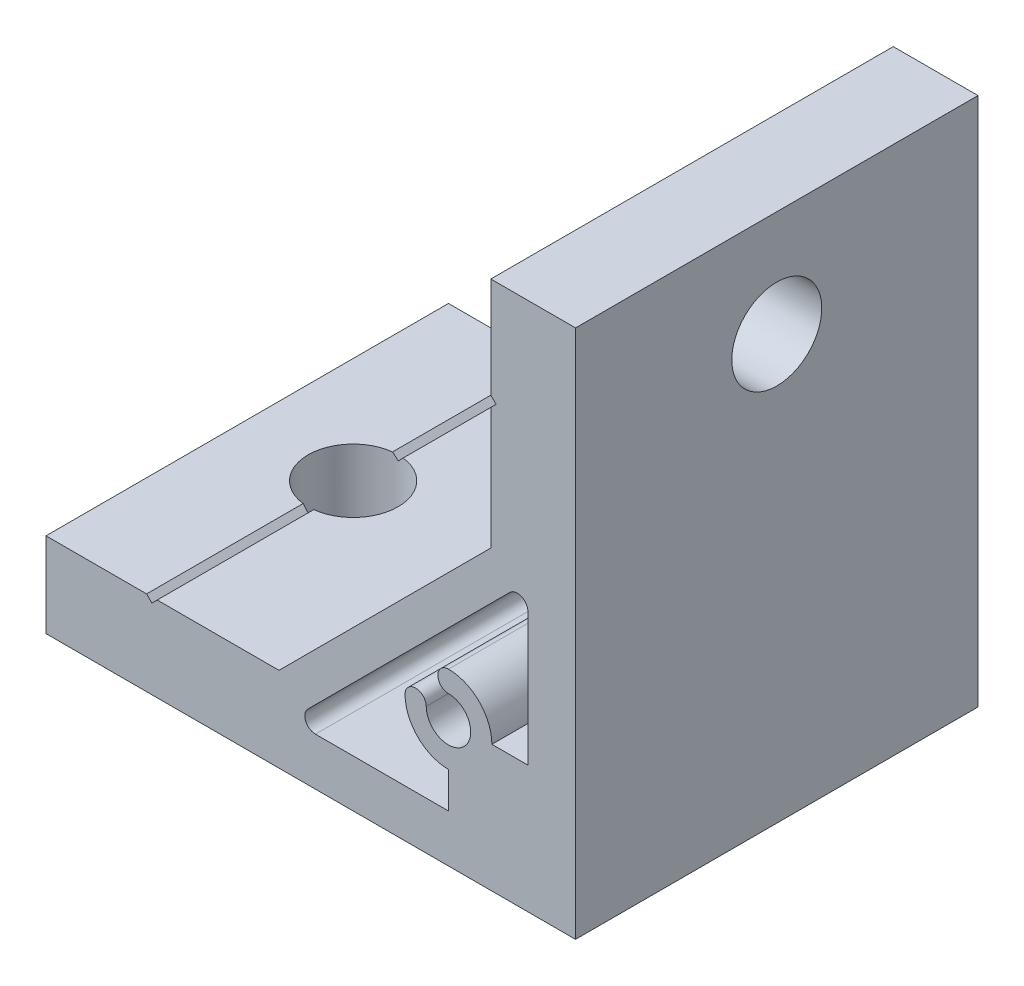
ISO-10303-21;
HEADER;
FILE_DESCRIPTION(('STEP AP214'),'2;1');
FILE_NAME('part.step','',(''),(''),'','','');
FILE_SCHEMA(('AUTOMOTIVE_DESIGN { 1 0 10303 214 1 1 1 1 }'));
ENDSEC;
DATA;
#1=APPLICATION_CONTEXT('core data for automotive mechanical design processes');
#2=APPLICATION_PROTOCOL_DEFINITION('international standard','automotive_design',2000,#1);
#3=PRODUCT_CONTEXT('',#1,'mechanical');
#4=PRODUCT('Part','Part','',(#3));
#5=PRODUCT_RELATED_PRODUCT_CATEGORY('part','',(#4));
#6=PRODUCT_DEFINITION_FORMATION('','',#4);
#7=PRODUCT_DEFINITION_CONTEXT('part definition',#1,'design');
#8=PRODUCT_DEFINITION('design','',#6,#7);
#9=PRODUCT_DEFINITION_SHAPE('','',#8);
#10=(LENGTH_UNIT() NAMED_UNIT(*) SI_UNIT(.MILLI.,.METRE.));
#11=(NAMED_UNIT(*) PLANE_ANGLE_UNIT() SI_UNIT($,.RADIAN.));
#12=(NAMED_UNIT(*) SI_UNIT($,.STERADIAN.) SOLID_ANGLE_UNIT());
#13=UNCERTAINTY_MEASURE_WITH_UNIT(LENGTH_MEASURE(1.E-05),#10,'distance_accuracy_value','');
#14=(GEOMETRIC_REPRESENTATION_CONTEXT(3) GLOBAL_UNCERTAINTY_ASSIGNED_CONTEXT((#13)) GLOBAL_UNIT_ASSIGNED_CONTEXT((#10,
#11,#12)) REPRESENTATION_CONTEXT('',''));
#15=CARTESIAN_POINT('',(0.,0.,0.));
#16=DIRECTION('',(0.,0.,1.));
#17=DIRECTION('',(1.,0.,0.));
#18=AXIS2_PLACEMENT_3D('',#15,#16,#17);
#19=CARTESIAN_POINT('',(-39.5,8.00000000000008,19.));
#20=DIRECTION('',(0.707106781186548,-0.707106781186548,0.));
#21=DIRECTION('',(0.707106781186548,0.707106781186548,0.));
#22=AXIS2_PLACEMENT_3D('',#19,#20,#21);
#23=PLANE('',#22);
#24=DIRECTION('',(0.,0.,-1.));
#25=VECTOR('',#24,1.);
#26=CARTESIAN_POINT('',(-39.5,8.00000000000008,19.));
#27=LINE('',#26,#25);
#28=CARTESIAN_POINT('',(-39.5,8.00000000000008,19.));
#29=VERTEX_POINT('',#28);
#30=CARTESIAN_POINT('',(-39.5,8.00000000000009,4.22048575403354));
#31=VERTEX_POINT('',#30);
#32=EDGE_CURVE('E264',#29,#31,#27,.T.);
#33=ORIENTED_EDGE('',*,*,#32,.T.);
#34=CARTESIAN_POINT('',(-40.,7.50000000000008,0.));
#35=DIRECTION('',(0.707106781186548,-0.707106781186548,0.));
#36=DIRECTION('',(0.707106781186548,0.707106781186548,0.));
#37=AXIS2_PLACEMENT_3D('',#34,#35,#36);
#38=ELLIPSE('',#37,6.01040764008561,4.25000000000001);
#39=CARTESIAN_POINT('',(-40.,7.50000000000008,4.25000000000001));
#40=VERTEX_POINT('',#39);
#41=EDGE_CURVE('E249',#31,#40,#38,.T.);
#42=ORIENTED_EDGE('',*,*,#41,.T.);
#43=DIRECTION('',(0.,0.,-1.));
#44=VECTOR('',#43,1.);
#45=CARTESIAN_POINT('',(-40.,7.50000000000008,19.));
#46=LINE('',#45,#44);
#47=CARTESIAN_POINT('',(-40.,7.50000000000008,19.));
#48=VERTEX_POINT('',#47);
#49=EDGE_CURVE('E248',#48,#40,#46,.T.);
#50=ORIENTED_EDGE('',*,*,#49,.F.);
#51=DIRECTION('',(-0.707106781186547,-0.707106781186547,0.));
#52=VECTOR('',#51,1.);
#53=CARTESIAN_POINT('',(-39.5,8.00000000000008,19.));
#54=LINE('',#53,#52);
#55=EDGE_CURVE('E365',#29,#48,#54,.T.);
#56=ORIENTED_EDGE('',*,*,#55,.F.);
#57=EDGE_LOOP('',(#33,#42,#50,#56));
#58=FACE_BOUND('',#57,.T.);
#59=ADVANCED_FACE('F34',(#58),#23,.F.);
#60=CARTESIAN_POINT('',(-40.,7.50000000000008,19.));
#61=DIRECTION('',(-0.707106781186549,-0.707106781186546,0.));
#62=DIRECTION('',(0.707106781186546,-0.707106781186549,0.));
#63=AXIS2_PLACEMENT_3D('',#60,#61,#62);
#64=PLANE('',#63);
#65=DIRECTION('',(0.,0.,-1.));
#66=VECTOR('',#65,1.);
#67=CARTESIAN_POINT('',(-40.5,8.00000000000008,19.));
#68=LINE('',#67,#66);
#69=CARTESIAN_POINT('',(-40.5,8.00000000000008,-4.22048575403354));
#70=VERTEX_POINT('',#69);
#71=CARTESIAN_POINT('',(-40.5,8.00000000000008,-19.));
#72=VERTEX_POINT('',#71);
#73=EDGE_CURVE('E256',#70,#72,#68,.T.);
#74=ORIENTED_EDGE('',*,*,#73,.F.);
#75=CARTESIAN_POINT('',(-40.,7.50000000000007,0.));
#76=DIRECTION('',(-0.707106781186549,-0.707106781186546,0.));
#77=DIRECTION('',(-0.707106781186546,0.707106781186549,0.));
#78=AXIS2_PLACEMENT_3D('',#75,#76,#77);
#79=ELLIPSE('',#78,6.01040764008572,4.25000000000001);
#80=CARTESIAN_POINT('',(-40.,7.50000000000008,-4.25000000000001));
#81=VERTEX_POINT('',#80);
#82=EDGE_CURVE('E49',#70,#81,#79,.T.);
#83=ORIENTED_EDGE('',*,*,#82,.T.);
#84=CARTESIAN_POINT('',(-40.,7.50000000000008,-19.));
#85=VERTEX_POINT('',#84);
#86=EDGE_CURVE('E255',#81,#85,#46,.T.);
#87=ORIENTED_EDGE('',*,*,#86,.T.);
#88=DIRECTION('',(-0.707106781186546,0.707106781186549,0.));
#89=VECTOR('',#88,1.);
#90=CARTESIAN_POINT('',(-40.,7.50000000000008,-19.));
#91=LINE('',#90,#89);
#92=EDGE_CURVE('E332',#85,#72,#91,.T.);
#93=ORIENTED_EDGE('',*,*,#92,.T.);
#94=EDGE_LOOP('',(#74,#83,#87,#93));
#95=FACE_BOUND('',#94,.T.);
#96=ADVANCED_FACE('F414',(#95),#64,.F.);
#97=CARTESIAN_POINT('',(-8.00000000000042,40.5,19.));
#98=DIRECTION('',(0.707106781186549,0.707106781186546,0.));
#99=DIRECTION('',(-0.707106781186546,0.707106781186549,0.));
#100=AXIS2_PLACEMENT_3D('',#97,#98,#99);
#101=PLANE('',#100);
#102=DIRECTION('',(0.,0.,-1.));
#103=VECTOR('',#102,1.);
#104=CARTESIAN_POINT('',(-8.00000000000042,40.5,19.));
#105=LINE('',#104,#103);
#106=CARTESIAN_POINT('',(-8.00000000000042,40.5,19.));
#107=VERTEX_POINT('',#106);
#108=CARTESIAN_POINT('',(-8.00000000000042,40.5,4.22048575403354));
#109=VERTEX_POINT('',#108);
#110=EDGE_CURVE('E282',#107,#109,#105,.T.);
#111=ORIENTED_EDGE('',*,*,#110,.T.);
#112=CARTESIAN_POINT('',(-7.50000000000042,40.,0.));
#113=DIRECTION('',(0.707106781186549,0.707106781186546,0.));
#114=DIRECTION('',(-0.707106781186546,0.707106781186549,0.));
#115=AXIS2_PLACEMENT_3D('',#112,#113,#114);
#116=ELLIPSE('',#115,6.01040764008585,4.25);
#117=CARTESIAN_POINT('',(-7.50000000000042,40.,4.25));
#118=VERTEX_POINT('',#117);
#119=EDGE_CURVE('E452',#109,#118,#116,.T.);
#120=ORIENTED_EDGE('',*,*,#119,.T.);
#121=DIRECTION('',(0.,0.,-1.));
#122=VECTOR('',#121,1.);
#123=CARTESIAN_POINT('',(-7.50000000000042,40.,19.));
#124=LINE('',#123,#122);
#125=CARTESIAN_POINT('',(-7.50000000000042,40.,19.));
#126=VERTEX_POINT('',#125);
#127=EDGE_CURVE('E278',#126,#118,#124,.T.);
#128=ORIENTED_EDGE('',*,*,#127,.F.);
#129=DIRECTION('',(0.707106781186546,-0.707106781186549,0.));
#130=VECTOR('',#129,1.);
#131=CARTESIAN_POINT('',(-8.00000000000042,40.5,19.));
#132=LINE('',#131,#130);
#133=EDGE_CURVE('E355',#107,#126,#132,.T.);
#134=ORIENTED_EDGE('',*,*,#133,.F.);
#135=EDGE_LOOP('',(#111,#120,#128,#134));
#136=FACE_BOUND('',#135,.T.);
#137=ADVANCED_FACE('F421',(#136),#101,.F.);
#138=CARTESIAN_POINT('',(-7.50000000000042,40.,19.));
#139=DIRECTION('',(0.707106781186549,-0.707106781186546,0.));
#140=DIRECTION('',(0.707106781186546,0.707106781186549,0.));
#141=AXIS2_PLACEMENT_3D('',#138,#139,#140);
#142=PLANE('',#141);
#143=DIRECTION('',(0.,0.,-1.));
#144=VECTOR('',#143,1.);
#145=CARTESIAN_POINT('',(-8.00000000000042,39.5,19.));
#146=LINE('',#145,#144);
#147=CARTESIAN_POINT('',(-8.00000000000042,39.5,-4.22048575403353));
#148=VERTEX_POINT('',#147);
#149=CARTESIAN_POINT('',(-8.00000000000042,39.5,-19.));
#150=VERTEX_POINT('',#149);
#151=EDGE_CURVE('E273',#148,#150,#146,.T.);
#152=ORIENTED_EDGE('',*,*,#151,.F.);
#153=CARTESIAN_POINT('',(-7.50000000000043,40.,0.));
#154=DIRECTION('',(0.707106781186549,-0.707106781186546,0.));
#155=DIRECTION('',(-0.707106781186546,-0.707106781186549,0.));
#156=AXIS2_PLACEMENT_3D('',#153,#154,#155);
#157=ELLIPSE('',#156,6.01040764008544,4.25);
#158=CARTESIAN_POINT('',(-7.50000000000042,40.,-4.25));
#159=VERTEX_POINT('',#158);
#160=EDGE_CURVE('E56',#148,#159,#157,.T.);
#161=ORIENTED_EDGE('',*,*,#160,.T.);
#162=CARTESIAN_POINT('',(-7.50000000000042,40.,-19.));
#163=VERTEX_POINT('',#162);
#164=EDGE_CURVE('E277',#159,#163,#124,.T.);
#165=ORIENTED_EDGE('',*,*,#164,.T.);
#166=DIRECTION('',(-0.707106781186546,-0.707106781186549,0.));
#167=VECTOR('',#166,1.);
#168=CARTESIAN_POINT('',(-7.50000000000042,40.,-19.));
#169=LINE('',#168,#167);
#170=EDGE_CURVE('E307',#163,#150,#169,.T.);
#171=ORIENTED_EDGE('',*,*,#170,.T.);
#172=EDGE_LOOP('',(#152,#161,#165,#171));
#173=FACE_BOUND('',#172,.T.);
#174=ADVANCED_FACE('F304',(#173),#142,.F.);
#175=CARTESIAN_POINT('',(0.,0.,19.));
#176=DIRECTION('',(0.,0.,1.));
#177=DIRECTION('',(1.,0.,0.));
#178=AXIS2_PLACEMENT_3D('',#175,#176,#177);
#179=PLANE('',#178);
#180=DIRECTION('',(0.,-1.,0.));
#181=VECTOR('',#180,1.);
#182=CARTESIAN_POINT('',(-50.,8.,19.));
#183=LINE('',#182,#181);
#184=CARTESIAN_POINT('',(-50.,8.,19.));
#185=VERTEX_POINT('',#184);
#186=CARTESIAN_POINT('',(-50.,0.,19.));
#187=VERTEX_POINT('',#186);
#188=EDGE_CURVE('E335',#185,#187,#183,.T.);
#189=ORIENTED_EDGE('',*,*,#188,.T.);
#190=DIRECTION('',(1.,0.,0.));
#191=VECTOR('',#190,1.);
#192=CARTESIAN_POINT('',(-50.,0.,19.));
#193=LINE('',#192,#191);
#194=CARTESIAN_POINT('',(0.,0.,19.));
#195=VERTEX_POINT('',#194);
#196=EDGE_CURVE('E339',#187,#195,#193,.T.);
#197=ORIENTED_EDGE('',*,*,#196,.T.);
#198=DIRECTION('',(0.,1.,0.));
#199=VECTOR('',#198,1.);
#200=CARTESIAN_POINT('',(0.,0.,19.));
#201=LINE('',#200,#199);
#202=CARTESIAN_POINT('',(0.,50.,19.));
#203=VERTEX_POINT('',#202);
#204=EDGE_CURVE('E344',#195,#203,#201,.T.);
#205=ORIENTED_EDGE('',*,*,#204,.T.);
#206=DIRECTION('',(-1.,0.,0.));
#207=VECTOR('',#206,1.);
#208=CARTESIAN_POINT('',(0.,50.,19.));
#209=LINE('',#208,#207);
#210=CARTESIAN_POINT('',(-8.00000000000009,50.,19.));
#211=VERTEX_POINT('',#210);
#212=EDGE_CURVE('E351',#203,#211,#209,.T.);
#213=ORIENTED_EDGE('',*,*,#212,.T.);
#214=DIRECTION('',(0.,-1.,0.));
#215=VECTOR('',#214,1.);
#216=CARTESIAN_POINT('',(-8.00000000000009,50.,19.));
#217=LINE('',#216,#215);
#218=EDGE_CURVE('E353',#211,#107,#217,.T.);
#219=ORIENTED_EDGE('',*,*,#218,.T.);
#220=ORIENTED_EDGE('',*,*,#133,.T.);
#221=DIRECTION('',(-0.707106781186546,-0.707106781186549,0.));
#222=VECTOR('',#221,1.);
#223=CARTESIAN_POINT('',(-7.50000000000042,40.,19.));
#224=LINE('',#223,#222);
#225=CARTESIAN_POINT('',(-8.00000000000042,39.5,19.));
#226=VERTEX_POINT('',#225);
#227=EDGE_CURVE('E357',#126,#226,#224,.T.);
#228=ORIENTED_EDGE('',*,*,#227,.T.);
#229=DIRECTION('',(0.,-1.,0.));
#230=VECTOR('',#229,1.);
#231=CARTESIAN_POINT('',(-8.00000000000042,39.5,19.));
#232=LINE('',#231,#230);
#233=CARTESIAN_POINT('',(-8.00000000000017,28.,19.));
#234=VERTEX_POINT('',#233);
#235=EDGE_CURVE('E359',#226,#234,#232,.T.);
#236=ORIENTED_EDGE('',*,*,#235,.T.);
#237=DIRECTION('',(-0.707106781186546,-0.707106781186549,0.));
#238=VECTOR('',#237,1.);
#239=CARTESIAN_POINT('',(-8.00000000000017,28.,19.));
#240=LINE('',#239,#238);
#241=CARTESIAN_POINT('',(-28.,8.00000000000008,19.));
#242=VERTEX_POINT('',#241);
#243=EDGE_CURVE('E361',#234,#242,#240,.T.);
#244=ORIENTED_EDGE('',*,*,#243,.T.);
#245=DIRECTION('',(-1.,0.,0.));
#246=VECTOR('',#245,1.);
#247=CARTESIAN_POINT('',(-28.,8.00000000000008,19.));
#248=LINE('',#247,#246);
#249=EDGE_CURVE('E363',#242,#29,#248,.T.);
#250=ORIENTED_EDGE('',*,*,#249,.T.);
#251=ORIENTED_EDGE('',*,*,#55,.T.);
#252=DIRECTION('',(-0.707106781186546,0.707106781186549,0.));
#253=VECTOR('',#252,1.);
#254=CARTESIAN_POINT('',(-40.,7.50000000000008,19.));
#255=LINE('',#254,#253);
#256=CARTESIAN_POINT('',(-40.5,8.00000000000008,19.));
#257=VERTEX_POINT('',#256);
#258=EDGE_CURVE('E367',#48,#257,#255,.T.);
#259=ORIENTED_EDGE('',*,*,#258,.T.);
#260=DIRECTION('',(-1.,0.,0.));
#261=VECTOR('',#260,1.);
#262=CARTESIAN_POINT('',(-40.5,8.00000000000008,19.));
#263=LINE('',#262,#261);
#264=EDGE_CURVE('E254',#257,#185,#263,.T.);
#265=ORIENTED_EDGE('',*,*,#264,.T.);
#266=EDGE_LOOP('',(#189,#197,#205,#213,#219,#220,#228,#236,#244,#250,#251,#259,#265));
#267=FACE_BOUND('',#266,.T.);
#268=DIRECTION('',(0.,1.,0.));
#269=VECTOR('',#268,1.);
#270=CARTESIAN_POINT('',(-4.5,12.,19.));
#271=LINE('',#270,#269);
#272=CARTESIAN_POINT('',(-4.5,12.,19.));
#273=VERTEX_POINT('',#272);
#274=CARTESIAN_POINT('',(-4.5,24.5603030380332,19.));
#275=VERTEX_POINT('',#274);
#276=EDGE_CURVE('E458',#273,#275,#271,.T.);
#277=ORIENTED_EDGE('',*,*,#276,.F.);
#278=DIRECTION('',(1.,0.,0.));
#279=VECTOR('',#278,1.);
#280=CARTESIAN_POINT('',(-7.9,12.,19.));
#281=LINE('',#280,#279);
#282=CARTESIAN_POINT('',(-7.9,12.,19.));
#283=VERTEX_POINT('',#282);
#284=EDGE_CURVE('E456',#283,#273,#281,.T.);
#285=ORIENTED_EDGE('',*,*,#284,.F.);
#286=CARTESIAN_POINT('',(-12.,12.,19.));
#287=DIRECTION('',(0.,0.,-1.));
#288=DIRECTION('',(-1.,0.,0.));
#289=AXIS2_PLACEMENT_3D('',#286,#287,#288);
#290=CIRCLE('',#289,4.1);
#291=CARTESIAN_POINT('',(-12.,16.1,19.));
#292=VERTEX_POINT('',#291);
#293=EDGE_CURVE('E480',#292,#283,#290,.T.);
#294=ORIENTED_EDGE('',*,*,#293,.F.);
#295=CARTESIAN_POINT('',(-12.,15.1,19.));
#296=DIRECTION('',(0.,0.,-1.));
#297=DIRECTION('',(-1.,0.,0.));
#298=AXIS2_PLACEMENT_3D('',#295,#296,#297);
#299=CIRCLE('',#298,1.);
#300=CARTESIAN_POINT('',(-12.,14.1,19.));
#301=VERTEX_POINT('',#300);
#302=EDGE_CURVE('E477',#301,#292,#299,.T.);
#303=ORIENTED_EDGE('',*,*,#302,.F.);
#304=CARTESIAN_POINT('',(-12.,12.,19.));
#305=DIRECTION('',(0.,0.,1.));
#306=DIRECTION('',(1.,0.,0.));
#307=AXIS2_PLACEMENT_3D('',#304,#305,#306);
#308=CIRCLE('',#307,2.1);
#309=CARTESIAN_POINT('',(-14.1,12.,19.));
#310=VERTEX_POINT('',#309);
#311=EDGE_CURVE('E475',#310,#301,#308,.T.);
#312=ORIENTED_EDGE('',*,*,#311,.F.);
#313=CARTESIAN_POINT('',(-15.1,12.,19.));
#314=DIRECTION('',(0.,0.,-1.));
#315=DIRECTION('',(-1.,0.,0.));
#316=AXIS2_PLACEMENT_3D('',#313,#314,#315);
#317=CIRCLE('',#316,1.);
#318=CARTESIAN_POINT('',(-16.1,12.,19.));
#319=VERTEX_POINT('',#318);
#320=EDGE_CURVE('E473',#319,#310,#317,.T.);
#321=ORIENTED_EDGE('',*,*,#320,.F.);
#322=CARTESIAN_POINT('',(-12.,12.,19.));
#323=DIRECTION('',(0.,0.,-1.));
#324=DIRECTION('',(-1.,0.,0.));
#325=AXIS2_PLACEMENT_3D('',#322,#323,#324);
#326=CIRCLE('',#325,4.1);
#327=CARTESIAN_POINT('',(-12.,7.9,19.));
#328=VERTEX_POINT('',#327);
#329=EDGE_CURVE('E471',#328,#319,#326,.T.);
#330=ORIENTED_EDGE('',*,*,#329,.F.);
#331=DIRECTION('',(0.,1.,0.));
#332=VECTOR('',#331,1.);
#333=CARTESIAN_POINT('',(-12.,4.5,19.));
#334=LINE('',#333,#332);
#335=CARTESIAN_POINT('',(-12.,4.5,19.));
#336=VERTEX_POINT('',#335);
#337=EDGE_CURVE('E469',#336,#328,#334,.T.);
#338=ORIENTED_EDGE('',*,*,#337,.F.);
#339=DIRECTION('',(1.,0.,0.));
#340=VECTOR('',#339,1.);
#341=CARTESIAN_POINT('',(-24.5603030380331,4.5,19.));
#342=LINE('',#341,#340);
#343=CARTESIAN_POINT('',(-24.5603030380331,4.5,19.));
#344=VERTEX_POINT('',#343);
#345=EDGE_CURVE('E467',#344,#336,#342,.T.);
#346=ORIENTED_EDGE('',*,*,#345,.F.);
#347=CARTESIAN_POINT('',(-24.5603030380331,5.5,19.));
#348=DIRECTION('',(0.,0.,1.));
#349=DIRECTION('',(1.,0.,0.));
#350=AXIS2_PLACEMENT_3D('',#347,#348,#349);
#351=CIRCLE('',#350,1.);
#352=CARTESIAN_POINT('',(-25.2674098192196,6.20710678118655,19.));
#353=VERTEX_POINT('',#352);
#354=EDGE_CURVE('E465',#353,#344,#351,.T.);
#355=ORIENTED_EDGE('',*,*,#354,.F.);
#356=DIRECTION('',(-0.707106781186546,-0.707106781186549,0.));
#357=VECTOR('',#356,1.);
#358=CARTESIAN_POINT('',(-6.20710678118655,25.2674098192197,19.));
#359=LINE('',#358,#357);
#360=CARTESIAN_POINT('',(-6.20710678118655,25.2674098192197,19.));
#361=VERTEX_POINT('',#360);
#362=EDGE_CURVE('E463',#361,#353,#359,.T.);
#363=ORIENTED_EDGE('',*,*,#362,.F.);
#364=CARTESIAN_POINT('',(-5.5,24.5603030380332,19.));
#365=DIRECTION('',(0.,0.,1.));
#366=DIRECTION('',(1.,0.,0.));
#367=AXIS2_PLACEMENT_3D('',#364,#365,#366);
#368=CIRCLE('',#367,0.999999999999999);
#369=EDGE_CURVE('E461',#275,#361,#368,.T.);
#370=ORIENTED_EDGE('',*,*,#369,.F.);
#371=EDGE_LOOP('',(#277,#285,#294,#303,#312,#321,#330,#338,#346,#355,#363,#370));
#372=FACE_BOUND('',#371,.T.);
#373=ADVANCED_FACE('F411',(#267,#372),#179,.T.);
#374=CARTESIAN_POINT('',(0.,0.,-19.));
#375=DIRECTION('',(0.,0.,1.));
#376=DIRECTION('',(1.,0.,0.));
#377=AXIS2_PLACEMENT_3D('',#374,#375,#376);
#378=PLANE('',#377);
#379=DIRECTION('',(0.,-1.,0.));
#380=VECTOR('',#379,1.);
#381=CARTESIAN_POINT('',(-50.,8.,-19.));
#382=LINE('',#381,#380);
#383=CARTESIAN_POINT('',(-50.,8.,-19.));
#384=VERTEX_POINT('',#383);
#385=CARTESIAN_POINT('',(-50.,0.,-19.));
#386=VERTEX_POINT('',#385);
#387=EDGE_CURVE('E370',#384,#386,#382,.T.);
#388=ORIENTED_EDGE('',*,*,#387,.F.);
#389=DIRECTION('',(-1.,0.,0.));
#390=VECTOR('',#389,1.);
#391=CARTESIAN_POINT('',(-40.5,8.00000000000008,-19.));
#392=LINE('',#391,#390);
#393=EDGE_CURVE('E334',#72,#384,#392,.T.);
#394=ORIENTED_EDGE('',*,*,#393,.F.);
#395=ORIENTED_EDGE('',*,*,#92,.F.);
#396=DIRECTION('',(-0.707106781186547,-0.707106781186547,0.));
#397=VECTOR('',#396,1.);
#398=CARTESIAN_POINT('',(-39.5,8.00000000000008,-19.));
#399=LINE('',#398,#397);
#400=CARTESIAN_POINT('',(-39.5,8.00000000000008,-19.));
#401=VERTEX_POINT('',#400);
#402=EDGE_CURVE('E329',#401,#85,#399,.T.);
#403=ORIENTED_EDGE('',*,*,#402,.F.);
#404=DIRECTION('',(-1.,0.,0.));
#405=VECTOR('',#404,1.);
#406=CARTESIAN_POINT('',(-28.,8.00000000000008,-19.));
#407=LINE('',#406,#405);
#408=CARTESIAN_POINT('',(-28.,8.00000000000008,-19.));
#409=VERTEX_POINT('',#408);
#410=EDGE_CURVE('E323',#409,#401,#407,.T.);
#411=ORIENTED_EDGE('',*,*,#410,.F.);
#412=DIRECTION('',(-0.707106781186546,-0.707106781186549,0.));
#413=VECTOR('',#412,1.);
#414=CARTESIAN_POINT('',(-8.00000000000017,28.,-19.));
#415=LINE('',#414,#413);
#416=CARTESIAN_POINT('',(-8.00000000000017,28.,-19.));
#417=VERTEX_POINT('',#416);
#418=EDGE_CURVE('E320',#417,#409,#415,.T.);
#419=ORIENTED_EDGE('',*,*,#418,.F.);
#420=DIRECTION('',(0.,-1.,0.));
#421=VECTOR('',#420,1.);
#422=CARTESIAN_POINT('',(-8.00000000000042,39.5,-19.));
#423=LINE('',#422,#421);
#424=EDGE_CURVE('E312',#150,#417,#423,.T.);
#425=ORIENTED_EDGE('',*,*,#424,.F.);
#426=ORIENTED_EDGE('',*,*,#170,.F.);
#427=DIRECTION('',(0.707106781186546,-0.707106781186549,0.));
#428=VECTOR('',#427,1.);
#429=CARTESIAN_POINT('',(-8.00000000000042,40.5,-19.));
#430=LINE('',#429,#428);
#431=CARTESIAN_POINT('',(-8.00000000000042,40.5,-19.));
#432=VERTEX_POINT('',#431);
#433=EDGE_CURVE('E313',#432,#163,#430,.T.);
#434=ORIENTED_EDGE('',*,*,#433,.F.);
#435=DIRECTION('',(0.,-1.,0.));
#436=VECTOR('',#435,1.);
#437=CARTESIAN_POINT('',(-8.00000000000009,50.,-19.));
#438=LINE('',#437,#436);
#439=CARTESIAN_POINT('',(-8.00000000000009,50.,-19.));
#440=VERTEX_POINT('',#439);
#441=EDGE_CURVE('E379',#440,#432,#438,.T.);
#442=ORIENTED_EDGE('',*,*,#441,.F.);
#443=DIRECTION('',(-1.,0.,0.));
#444=VECTOR('',#443,1.);
#445=CARTESIAN_POINT('',(0.,50.,-19.));
#446=LINE('',#445,#444);
#447=CARTESIAN_POINT('',(0.,50.,-19.));
#448=VERTEX_POINT('',#447);
#449=EDGE_CURVE('E377',#448,#440,#446,.T.);
#450=ORIENTED_EDGE('',*,*,#449,.F.);
#451=DIRECTION('',(0.,1.,0.));
#452=VECTOR('',#451,1.);
#453=CARTESIAN_POINT('',(0.,0.,-19.));
#454=LINE('',#453,#452);
#455=CARTESIAN_POINT('',(0.,0.,-19.));
#456=VERTEX_POINT('',#455);
#457=EDGE_CURVE('E375',#456,#448,#454,.T.);
#458=ORIENTED_EDGE('',*,*,#457,.F.);
#459=DIRECTION('',(1.,0.,0.));
#460=VECTOR('',#459,1.);
#461=CARTESIAN_POINT('',(-50.,0.,-19.));
#462=LINE('',#461,#460);
#463=EDGE_CURVE('E373',#386,#456,#462,.T.);
#464=ORIENTED_EDGE('',*,*,#463,.F.);
#465=EDGE_LOOP('',(#388,#394,#395,#403,#411,#419,#425,#426,#434,#442,#450,#458,#464));
#466=FACE_BOUND('',#465,.T.);
#467=DIRECTION('',(1.,0.,0.));
#468=VECTOR('',#467,1.);
#469=CARTESIAN_POINT('',(-7.9,12.,-19.));
#470=LINE('',#469,#468);
#471=CARTESIAN_POINT('',(-7.9,12.,-19.));
#472=VERTEX_POINT('',#471);
#473=CARTESIAN_POINT('',(-4.5,12.,-19.));
#474=VERTEX_POINT('',#473);
#475=EDGE_CURVE('E483',#472,#474,#470,.T.);
#476=ORIENTED_EDGE('',*,*,#475,.T.);
#477=DIRECTION('',(0.,1.,0.));
#478=VECTOR('',#477,1.);
#479=CARTESIAN_POINT('',(-4.5,12.,-19.));
#480=LINE('',#479,#478);
#481=CARTESIAN_POINT('',(-4.5,24.5603030380332,-19.));
#482=VERTEX_POINT('',#481);
#483=EDGE_CURVE('E486',#474,#482,#480,.T.);
#484=ORIENTED_EDGE('',*,*,#483,.T.);
#485=CARTESIAN_POINT('',(-5.5,24.5603030380332,-19.));
#486=DIRECTION('',(0.,0.,1.));
#487=DIRECTION('',(1.,0.,0.));
#488=AXIS2_PLACEMENT_3D('',#485,#486,#487);
#489=CIRCLE('',#488,0.999999999999999);
#490=CARTESIAN_POINT('',(-6.20710678118655,25.2674098192197,-19.));
#491=VERTEX_POINT('',#490);
#492=EDGE_CURVE('E489',#482,#491,#489,.T.);
#493=ORIENTED_EDGE('',*,*,#492,.T.);
#494=DIRECTION('',(-0.707106781186546,-0.707106781186549,0.));
#495=VECTOR('',#494,1.);
#496=CARTESIAN_POINT('',(-6.20710678118655,25.2674098192197,-19.));
#497=LINE('',#496,#495);
#498=CARTESIAN_POINT('',(-25.2674098192196,6.20710678118655,-19.));
#499=VERTEX_POINT('',#498);
#500=EDGE_CURVE('E492',#491,#499,#497,.T.);
#501=ORIENTED_EDGE('',*,*,#500,.T.);
#502=CARTESIAN_POINT('',(-24.5603030380331,5.5,-19.));
#503=DIRECTION('',(0.,0.,1.));
#504=DIRECTION('',(1.,0.,0.));
#505=AXIS2_PLACEMENT_3D('',#502,#503,#504);
#506=CIRCLE('',#505,1.);
#507=CARTESIAN_POINT('',(-24.5603030380331,4.5,-19.));
#508=VERTEX_POINT('',#507);
#509=EDGE_CURVE('E495',#499,#508,#506,.T.);
#510=ORIENTED_EDGE('',*,*,#509,.T.);
#511=DIRECTION('',(1.,0.,0.));
#512=VECTOR('',#511,1.);
#513=CARTESIAN_POINT('',(-24.5603030380331,4.5,-19.));
#514=LINE('',#513,#512);
#515=CARTESIAN_POINT('',(-12.,4.5,-19.));
#516=VERTEX_POINT('',#515);
#517=EDGE_CURVE('E498',#508,#516,#514,.T.);
#518=ORIENTED_EDGE('',*,*,#517,.T.);
#519=DIRECTION('',(0.,1.,0.));
#520=VECTOR('',#519,1.);
#521=CARTESIAN_POINT('',(-12.,4.5,-19.));
#522=LINE('',#521,#520);
#523=CARTESIAN_POINT('',(-12.,7.9,-19.));
#524=VERTEX_POINT('',#523);
#525=EDGE_CURVE('E501',#516,#524,#522,.T.);
#526=ORIENTED_EDGE('',*,*,#525,.T.);
#527=CARTESIAN_POINT('',(-12.,12.,-19.));
#528=DIRECTION('',(0.,0.,-1.));
#529=DIRECTION('',(-1.,0.,0.));
#530=AXIS2_PLACEMENT_3D('',#527,#528,#529);
#531=CIRCLE('',#530,4.1);
#532=CARTESIAN_POINT('',(-16.1,12.,-19.));
#533=VERTEX_POINT('',#532);
#534=EDGE_CURVE('E504',#524,#533,#531,.T.);
#535=ORIENTED_EDGE('',*,*,#534,.T.);
#536=CARTESIAN_POINT('',(-15.1,12.,-19.));
#537=DIRECTION('',(0.,0.,-1.));
#538=DIRECTION('',(-1.,0.,0.));
#539=AXIS2_PLACEMENT_3D('',#536,#537,#538);
#540=CIRCLE('',#539,1.);
#541=CARTESIAN_POINT('',(-14.1,12.,-19.));
#542=VERTEX_POINT('',#541);
#543=EDGE_CURVE('E507',#533,#542,#540,.T.);
#544=ORIENTED_EDGE('',*,*,#543,.T.);
#545=CARTESIAN_POINT('',(-12.,12.,-19.));
#546=DIRECTION('',(0.,0.,1.));
#547=DIRECTION('',(1.,0.,0.));
#548=AXIS2_PLACEMENT_3D('',#545,#546,#547);
#549=CIRCLE('',#548,2.1);
#550=CARTESIAN_POINT('',(-12.,14.1,-19.));
#551=VERTEX_POINT('',#550);
#552=EDGE_CURVE('E510',#542,#551,#549,.T.);
#553=ORIENTED_EDGE('',*,*,#552,.T.);
#554=CARTESIAN_POINT('',(-12.,15.1,-19.));
#555=DIRECTION('',(0.,0.,-1.));
#556=DIRECTION('',(-1.,0.,0.));
#557=AXIS2_PLACEMENT_3D('',#554,#555,#556);
#558=CIRCLE('',#557,1.);
#559=CARTESIAN_POINT('',(-12.,16.1,-19.));
#560=VERTEX_POINT('',#559);
#561=EDGE_CURVE('E513',#551,#560,#558,.T.);
#562=ORIENTED_EDGE('',*,*,#561,.T.);
#563=CARTESIAN_POINT('',(-12.,12.,-19.));
#564=DIRECTION('',(0.,0.,-1.));
#565=DIRECTION('',(-1.,0.,0.));
#566=AXIS2_PLACEMENT_3D('',#563,#564,#565);
#567=CIRCLE('',#566,4.1);
#568=EDGE_CURVE('E459',#560,#472,#567,.T.);
#569=ORIENTED_EDGE('',*,*,#568,.T.);
#570=EDGE_LOOP('',(#476,#484,#493,#501,#510,#518,#526,#535,#544,#553,#562,#569));
#571=FACE_BOUND('',#570,.T.);
#572=ADVANCED_FACE('F317',(#466,#571),#378,.F.);
#573=CARTESIAN_POINT('',(-50.,8.,19.));
#574=DIRECTION('',(1.,0.,0.));
#575=DIRECTION('',(0.,1.,0.));
#576=AXIS2_PLACEMENT_3D('',#573,#574,#575);
#577=PLANE('',#576);
#578=ORIENTED_EDGE('',*,*,#387,.T.);
#579=DIRECTION('',(0.,0.,-1.));
#580=VECTOR('',#579,1.);
#581=CARTESIAN_POINT('',(-50.,0.,19.));
#582=LINE('',#581,#580);
#583=EDGE_CURVE('E294',#187,#386,#582,.T.);
#584=ORIENTED_EDGE('',*,*,#583,.F.);
#585=ORIENTED_EDGE('',*,*,#188,.F.);
#586=DIRECTION('',(0.,0.,-1.));
#587=VECTOR('',#586,1.);
#588=CARTESIAN_POINT('',(-50.,8.,19.));
#589=LINE('',#588,#587);
#590=EDGE_CURVE('E259',#185,#384,#589,.T.);
#591=ORIENTED_EDGE('',*,*,#590,.T.);
#592=EDGE_LOOP('',(#578,#584,#585,#591));
#593=FACE_BOUND('',#592,.T.);
#594=ADVANCED_FACE('F36',(#593),#577,.F.);
#595=CARTESIAN_POINT('',(-50.,0.,19.));
#596=DIRECTION('',(0.,1.,0.));
#597=DIRECTION('',(-1.,0.,0.));
#598=AXIS2_PLACEMENT_3D('',#595,#596,#597);
#599=PLANE('',#598);
#600=CARTESIAN_POINT('',(-40.,-3.29597460435593E-13,0.));
#601=DIRECTION('',(0.,1.,0.));
#602=DIRECTION('',(-1.,0.,0.));
#603=AXIS2_PLACEMENT_3D('',#600,#601,#602);
#604=CIRCLE('',#603,4.25000000000001);
#605=CARTESIAN_POINT('',(-44.25,-3.64520183044074E-13,0.));
#606=VERTEX_POINT('',#605);
#607=EDGE_CURVE('E250',#606,#606,#604,.T.);
#608=ORIENTED_EDGE('',*,*,#607,.T.);
#609=EDGE_LOOP('',(#608));
#610=FACE_BOUND('',#609,.T.);
#611=ORIENTED_EDGE('',*,*,#463,.T.);
#612=DIRECTION('',(0.,0.,-1.));
#613=VECTOR('',#612,1.);
#614=CARTESIAN_POINT('',(0.,0.,19.));
#615=LINE('',#614,#613);
#616=EDGE_CURVE('E291',#195,#456,#615,.T.);
#617=ORIENTED_EDGE('',*,*,#616,.F.);
#618=ORIENTED_EDGE('',*,*,#196,.F.);
#619=ORIENTED_EDGE('',*,*,#583,.T.);
#620=EDGE_LOOP('',(#611,#617,#618,#619));
#621=FACE_BOUND('',#620,.T.);
#622=ADVANCED_FACE('F403',(#610,#621),#599,.F.);
#623=CARTESIAN_POINT('',(0.,0.,19.));
#624=DIRECTION('',(-1.,0.,0.));
#625=DIRECTION('',(0.,0.,1.));
#626=AXIS2_PLACEMENT_3D('',#623,#624,#625);
#627=PLANE('',#626);
#628=CARTESIAN_POINT('',(1.38777878078145E-12,39.9999999999998,0.));
#629=DIRECTION('',(-1.,0.,0.));
#630=DIRECTION('',(0.,-1.,0.));
#631=AXIS2_PLACEMENT_3D('',#628,#629,#630);
#632=CIRCLE('',#631,4.25);
#633=CARTESIAN_POINT('',(1.24032728532342E-12,35.7499999999998,0.));
#634=VERTEX_POINT('',#633);
#635=EDGE_CURVE('E446',#634,#634,#632,.T.);
#636=ORIENTED_EDGE('',*,*,#635,.T.);
#637=EDGE_LOOP('',(#636));
#638=FACE_BOUND('',#637,.T.);
#639=ORIENTED_EDGE('',*,*,#457,.T.);
#640=DIRECTION('',(0.,0.,-1.));
#641=VECTOR('',#640,1.);
#642=CARTESIAN_POINT('',(0.,50.,19.));
#643=LINE('',#642,#641);
#644=EDGE_CURVE('E288',#203,#448,#643,.T.);
#645=ORIENTED_EDGE('',*,*,#644,.F.);
#646=ORIENTED_EDGE('',*,*,#204,.F.);
#647=ORIENTED_EDGE('',*,*,#616,.T.);
#648=EDGE_LOOP('',(#639,#645,#646,#647));
#649=FACE_BOUND('',#648,.T.);
#650=ADVANCED_FACE('F400',(#638,#649),#627,.F.);
#651=CARTESIAN_POINT('',(0.,50.,19.));
#652=DIRECTION('',(0.,-1.,0.));
#653=DIRECTION('',(0.,0.,-1.));
#654=AXIS2_PLACEMENT_3D('',#651,#652,#653);
#655=PLANE('',#654);
#656=ORIENTED_EDGE('',*,*,#449,.T.);
#657=DIRECTION('',(0.,0.,-1.));
#658=VECTOR('',#657,1.);
#659=CARTESIAN_POINT('',(-8.00000000000009,50.,19.));
#660=LINE('',#659,#658);
#661=EDGE_CURVE('E285',#211,#440,#660,.T.);
#662=ORIENTED_EDGE('',*,*,#661,.F.);
#663=ORIENTED_EDGE('',*,*,#212,.F.);
#664=ORIENTED_EDGE('',*,*,#644,.T.);
#665=EDGE_LOOP('',(#656,#662,#663,#664));
#666=FACE_BOUND('',#665,.T.);
#667=ADVANCED_FACE('F396',(#666),#655,.F.);
#668=CARTESIAN_POINT('',(-8.00000000000009,50.,19.));
#669=DIRECTION('',(1.,0.,0.));
#670=DIRECTION('',(0.,1.,0.));
#671=AXIS2_PLACEMENT_3D('',#668,#669,#670);
#672=PLANE('',#671);
#673=CARTESIAN_POINT('',(-8.00000000000042,40.5,-4.22048575403354));
#674=VERTEX_POINT('',#673);
#675=EDGE_CURVE('E281',#674,#432,#105,.T.);
#676=ORIENTED_EDGE('',*,*,#675,.F.);
#677=CARTESIAN_POINT('',(-8.00000000000044,40.0000000000001,0.));
#678=DIRECTION('',(-1.,0.,0.));
#679=DIRECTION('',(0.,-1.,0.));
#680=AXIS2_PLACEMENT_3D('',#677,#678,#679);
#681=CIRCLE('',#680,4.25);
#682=EDGE_CURVE('E440',#109,#674,#681,.T.);
#683=ORIENTED_EDGE('',*,*,#682,.F.);
#684=ORIENTED_EDGE('',*,*,#110,.F.);
#685=ORIENTED_EDGE('',*,*,#218,.F.);
#686=ORIENTED_EDGE('',*,*,#661,.T.);
#687=ORIENTED_EDGE('',*,*,#441,.T.);
#688=EDGE_LOOP('',(#676,#683,#684,#685,#686,#687));
#689=FACE_BOUND('',#688,.T.);
#690=ADVANCED_FACE('F389',(#689),#672,.F.);
#691=ORIENTED_EDGE('',*,*,#164,.F.);
#692=EDGE_CURVE('E455',#159,#674,#116,.T.);
#693=ORIENTED_EDGE('',*,*,#692,.T.);
#694=ORIENTED_EDGE('',*,*,#675,.T.);
#695=ORIENTED_EDGE('',*,*,#433,.T.);
#696=EDGE_LOOP('',(#691,#693,#694,#695));
#697=FACE_BOUND('',#696,.T.);
#698=ADVANCED_FACE('F382',(#697),#101,.F.);
#699=ORIENTED_EDGE('',*,*,#127,.T.);
#700=CARTESIAN_POINT('',(-8.00000000000046,39.5,4.22048575403353));
#701=VERTEX_POINT('',#700);
#702=EDGE_CURVE('E449',#118,#701,#157,.T.);
#703=ORIENTED_EDGE('',*,*,#702,.T.);
#704=EDGE_CURVE('E274',#226,#701,#146,.T.);
#705=ORIENTED_EDGE('',*,*,#704,.F.);
#706=ORIENTED_EDGE('',*,*,#227,.F.);
#707=EDGE_LOOP('',(#699,#703,#705,#706));
#708=FACE_BOUND('',#707,.T.);
#709=ADVANCED_FACE('F706',(#708),#142,.F.);
#710=CARTESIAN_POINT('',(-8.00000000000042,39.5,19.));
#711=DIRECTION('',(1.,0.,0.));
#712=DIRECTION('',(0.,1.,0.));
#713=AXIS2_PLACEMENT_3D('',#710,#711,#712);
#714=PLANE('',#713);
#715=ORIENTED_EDGE('',*,*,#704,.T.);
#716=CARTESIAN_POINT('',(-8.00000000000043,40.0000000000001,0.));
#717=DIRECTION('',(1.,0.,0.));
#718=DIRECTION('',(0.,1.,0.));
#719=AXIS2_PLACEMENT_3D('',#716,#717,#718);
#720=CIRCLE('',#719,4.25);
#721=EDGE_CURVE('E42',#701,#148,#720,.T.);
#722=ORIENTED_EDGE('',*,*,#721,.T.);
#723=ORIENTED_EDGE('',*,*,#151,.T.);
#724=ORIENTED_EDGE('',*,*,#424,.T.);
#725=DIRECTION('',(0.,0.,-1.));
#726=VECTOR('',#725,1.);
#727=CARTESIAN_POINT('',(-8.00000000000017,28.,19.));
#728=LINE('',#727,#726);
#729=EDGE_CURVE('E270',#234,#417,#728,.T.);
#730=ORIENTED_EDGE('',*,*,#729,.F.);
#731=ORIENTED_EDGE('',*,*,#235,.F.);
#732=EDGE_LOOP('',(#715,#722,#723,#724,#730,#731));
#733=FACE_BOUND('',#732,.T.);
#734=ADVANCED_FACE('F298',(#733),#714,.F.);
#735=CARTESIAN_POINT('',(-8.00000000000017,28.,19.));
#736=DIRECTION('',(0.707106781186549,-0.707106781186546,0.));
#737=DIRECTION('',(0.707106781186546,0.707106781186549,0.));
#738=AXIS2_PLACEMENT_3D('',#735,#736,#737);
#739=PLANE('',#738);
#740=ORIENTED_EDGE('',*,*,#418,.T.);
#741=DIRECTION('',(0.,0.,-1.));
#742=VECTOR('',#741,1.);
#743=CARTESIAN_POINT('',(-28.,8.00000000000008,19.));
#744=LINE('',#743,#742);
#745=EDGE_CURVE('E267',#242,#409,#744,.T.);
#746=ORIENTED_EDGE('',*,*,#745,.F.);
#747=ORIENTED_EDGE('',*,*,#243,.F.);
#748=ORIENTED_EDGE('',*,*,#729,.T.);
#749=EDGE_LOOP('',(#740,#746,#747,#748));
#750=FACE_BOUND('',#749,.T.);
#751=ADVANCED_FACE('F432',(#750),#739,.F.);
#752=CARTESIAN_POINT('',(-28.,8.00000000000008,19.));
#753=DIRECTION('',(0.,-1.,0.));
#754=DIRECTION('',(1.,0.,0.));
#755=AXIS2_PLACEMENT_3D('',#752,#753,#754);
#756=PLANE('',#755);
#757=CARTESIAN_POINT('',(-39.5,8.00000000000009,-4.22048575403354));
#758=VERTEX_POINT('',#757);
#759=EDGE_CURVE('E263',#758,#401,#27,.T.);
#760=ORIENTED_EDGE('',*,*,#759,.F.);
#761=CARTESIAN_POINT('',(-40.,8.00000000000008,0.));
#762=DIRECTION('',(0.,1.,0.));
#763=DIRECTION('',(-1.,0.,0.));
#764=AXIS2_PLACEMENT_3D('',#761,#762,#763);
#765=CIRCLE('',#764,4.25000000000001);
#766=EDGE_CURVE('E443',#31,#758,#765,.T.);
#767=ORIENTED_EDGE('',*,*,#766,.F.);
#768=ORIENTED_EDGE('',*,*,#32,.F.);
#769=ORIENTED_EDGE('',*,*,#249,.F.);
#770=ORIENTED_EDGE('',*,*,#745,.T.);
#771=ORIENTED_EDGE('',*,*,#410,.T.);
#772=EDGE_LOOP('',(#760,#767,#768,#769,#770,#771));
#773=FACE_BOUND('',#772,.T.);
#774=ADVANCED_FACE('F426',(#773),#756,.F.);
#775=ORIENTED_EDGE('',*,*,#86,.F.);
#776=EDGE_CURVE('E436',#81,#758,#38,.T.);
#777=ORIENTED_EDGE('',*,*,#776,.T.);
#778=ORIENTED_EDGE('',*,*,#759,.T.);
#779=ORIENTED_EDGE('',*,*,#402,.T.);
#780=EDGE_LOOP('',(#775,#777,#778,#779));
#781=FACE_BOUND('',#780,.T.);
#782=ADVANCED_FACE('F417',(#781),#23,.F.);
#783=ORIENTED_EDGE('',*,*,#49,.T.);
#784=CARTESIAN_POINT('',(-40.5,8.00000000000008,4.22048575403354));
#785=VERTEX_POINT('',#784);
#786=EDGE_CURVE('E235',#40,#785,#79,.T.);
#787=ORIENTED_EDGE('',*,*,#786,.T.);
#788=EDGE_CURVE('E245',#257,#785,#68,.T.);
#789=ORIENTED_EDGE('',*,*,#788,.F.);
#790=ORIENTED_EDGE('',*,*,#258,.F.);
#791=EDGE_LOOP('',(#783,#787,#789,#790));
#792=FACE_BOUND('',#791,.T.);
#793=ADVANCED_FACE('F243',(#792),#64,.F.);
#794=CARTESIAN_POINT('',(-40.5,8.00000000000008,19.));
#795=DIRECTION('',(0.,-1.,0.));
#796=DIRECTION('',(1.,0.,0.));
#797=AXIS2_PLACEMENT_3D('',#794,#795,#796);
#798=PLANE('',#797);
#799=ORIENTED_EDGE('',*,*,#788,.T.);
#800=CARTESIAN_POINT('',(-40.,8.00000000000008,0.));
#801=DIRECTION('',(0.,-1.,0.));
#802=DIRECTION('',(1.,0.,0.));
#803=AXIS2_PLACEMENT_3D('',#800,#801,#802);
#804=CIRCLE('',#803,4.25000000000001);
#805=EDGE_CURVE('E11',#785,#70,#804,.T.);
#806=ORIENTED_EDGE('',*,*,#805,.T.);
#807=ORIENTED_EDGE('',*,*,#73,.T.);
#808=ORIENTED_EDGE('',*,*,#393,.T.);
#809=ORIENTED_EDGE('',*,*,#590,.F.);
#810=ORIENTED_EDGE('',*,*,#264,.F.);
#811=EDGE_LOOP('',(#799,#806,#807,#808,#809,#810));
#812=FACE_BOUND('',#811,.T.);
#813=ADVANCED_FACE('F252',(#812),#798,.F.);
#814=CARTESIAN_POINT('',(-7.9,12.,19.));
#815=DIRECTION('',(0.,1.,0.));
#816=DIRECTION('',(0.,0.,1.));
#817=AXIS2_PLACEMENT_3D('',#814,#815,#816);
#818=PLANE('',#817);
#819=ORIENTED_EDGE('',*,*,#475,.F.);
#820=DIRECTION('',(0.,0.,-1.));
#821=VECTOR('',#820,1.);
#822=CARTESIAN_POINT('',(-7.9,12.,19.));
#823=LINE('',#822,#821);
#824=EDGE_CURVE('E482',#283,#472,#823,.T.);
#825=ORIENTED_EDGE('',*,*,#824,.F.);
#826=ORIENTED_EDGE('',*,*,#284,.T.);
#827=DIRECTION('',(0.,0.,-1.));
#828=VECTOR('',#827,1.);
#829=CARTESIAN_POINT('',(-4.5,12.,19.));
#830=LINE('',#829,#828);
#831=EDGE_CURVE('E347',#273,#474,#830,.T.);
#832=ORIENTED_EDGE('',*,*,#831,.T.);
#833=EDGE_LOOP('',(#819,#825,#826,#832));
#834=FACE_BOUND('',#833,.T.);
#835=ADVANCED_FACE('F544',(#834),#818,.T.);
#836=CARTESIAN_POINT('',(-4.5,12.,19.));
#837=DIRECTION('',(-1.,0.,0.));
#838=DIRECTION('',(0.,-1.,0.));
#839=AXIS2_PLACEMENT_3D('',#836,#837,#838);
#840=PLANE('',#839);
#841=ORIENTED_EDGE('',*,*,#483,.F.);
#842=ORIENTED_EDGE('',*,*,#831,.F.);
#843=ORIENTED_EDGE('',*,*,#276,.T.);
#844=DIRECTION('',(0.,0.,-1.));
#845=VECTOR('',#844,1.);
#846=CARTESIAN_POINT('',(-4.5,24.5603030380332,19.));
#847=LINE('',#846,#845);
#848=EDGE_CURVE('E537',#275,#482,#847,.T.);
#849=ORIENTED_EDGE('',*,*,#848,.T.);
#850=EDGE_LOOP('',(#841,#842,#843,#849));
#851=FACE_BOUND('',#850,.T.);
#852=ADVANCED_FACE('F557',(#851),#840,.T.);
#853=CARTESIAN_POINT('',(-5.5,24.5603030380332,19.));
#854=DIRECTION('',(0.,0.,-1.));
#855=DIRECTION('',(-1.,0.,0.));
#856=AXIS2_PLACEMENT_3D('',#853,#854,#855);
#857=CYLINDRICAL_SURFACE('',#856,0.999999999999999);
#858=ORIENTED_EDGE('',*,*,#492,.F.);
#859=ORIENTED_EDGE('',*,*,#848,.F.);
#860=ORIENTED_EDGE('',*,*,#369,.T.);
#861=DIRECTION('',(0.,0.,-1.));
#862=VECTOR('',#861,1.);
#863=CARTESIAN_POINT('',(-6.20710678118655,25.2674098192197,19.));
#864=LINE('',#863,#862);
#865=EDGE_CURVE('E536',#361,#491,#864,.T.);
#866=ORIENTED_EDGE('',*,*,#865,.T.);
#867=EDGE_LOOP('',(#858,#859,#860,#866));
#868=FACE_BOUND('',#867,.T.);
#869=ADVANCED_FACE('F559',(#868),#857,.F.);
#870=CARTESIAN_POINT('',(-6.20710678118655,25.2674098192197,19.));
#871=DIRECTION('',(0.707106781186549,-0.707106781186546,0.));
#872=DIRECTION('',(0.707106781186546,0.707106781186549,0.));
#873=AXIS2_PLACEMENT_3D('',#870,#871,#872);
#874=PLANE('',#873);
#875=ORIENTED_EDGE('',*,*,#500,.F.);
#876=ORIENTED_EDGE('',*,*,#865,.F.);
#877=ORIENTED_EDGE('',*,*,#362,.T.);
#878=DIRECTION('',(0.,0.,-1.));
#879=VECTOR('',#878,1.);
#880=CARTESIAN_POINT('',(-25.2674098192196,6.20710678118655,19.));
#881=LINE('',#880,#879);
#882=EDGE_CURVE('E534',#353,#499,#881,.T.);
#883=ORIENTED_EDGE('',*,*,#882,.T.);
#884=EDGE_LOOP('',(#875,#876,#877,#883));
#885=FACE_BOUND('',#884,.T.);
#886=ADVANCED_FACE('F564',(#885),#874,.T.);
#887=CARTESIAN_POINT('',(-24.5603030380331,5.5,19.));
#888=DIRECTION('',(0.,0.,-1.));
#889=DIRECTION('',(-1.,0.,0.));
#890=AXIS2_PLACEMENT_3D('',#887,#888,#889);
#891=CYLINDRICAL_SURFACE('',#890,1.);
#892=ORIENTED_EDGE('',*,*,#509,.F.);
#893=ORIENTED_EDGE('',*,*,#882,.F.);
#894=ORIENTED_EDGE('',*,*,#354,.T.);
#895=DIRECTION('',(0.,0.,-1.));
#896=VECTOR('',#895,1.);
#897=CARTESIAN_POINT('',(-24.5603030380331,4.5,19.));
#898=LINE('',#897,#896);
#899=EDGE_CURVE('E532',#344,#508,#898,.T.);
#900=ORIENTED_EDGE('',*,*,#899,.T.);
#901=EDGE_LOOP('',(#892,#893,#894,#900));
#902=FACE_BOUND('',#901,.T.);
#903=ADVANCED_FACE('F568',(#902),#891,.F.);
#904=CARTESIAN_POINT('',(-24.5603030380331,4.5,19.));
#905=DIRECTION('',(0.,1.,0.));
#906=DIRECTION('',(0.,0.,1.));
#907=AXIS2_PLACEMENT_3D('',#904,#905,#906);
#908=PLANE('',#907);
#909=ORIENTED_EDGE('',*,*,#517,.F.);
#910=ORIENTED_EDGE('',*,*,#899,.F.);
#911=ORIENTED_EDGE('',*,*,#345,.T.);
#912=DIRECTION('',(0.,0.,-1.));
#913=VECTOR('',#912,1.);
#914=CARTESIAN_POINT('',(-12.,4.5,19.));
#915=LINE('',#914,#913);
#916=EDGE_CURVE('E530',#336,#516,#915,.T.);
#917=ORIENTED_EDGE('',*,*,#916,.T.);
#918=EDGE_LOOP('',(#909,#910,#911,#917));
#919=FACE_BOUND('',#918,.T.);
#920=ADVANCED_FACE('F573',(#919),#908,.T.);
#921=CARTESIAN_POINT('',(-12.,4.5,19.));
#922=DIRECTION('',(-1.,0.,0.));
#923=DIRECTION('',(0.,-1.,0.));
#924=AXIS2_PLACEMENT_3D('',#921,#922,#923);
#925=PLANE('',#924);
#926=ORIENTED_EDGE('',*,*,#525,.F.);
#927=ORIENTED_EDGE('',*,*,#916,.F.);
#928=ORIENTED_EDGE('',*,*,#337,.T.);
#929=DIRECTION('',(0.,0.,-1.));
#930=VECTOR('',#929,1.);
#931=CARTESIAN_POINT('',(-12.,7.9,19.));
#932=LINE('',#931,#930);
#933=EDGE_CURVE('E528',#328,#524,#932,.T.);
#934=ORIENTED_EDGE('',*,*,#933,.T.);
#935=EDGE_LOOP('',(#926,#927,#928,#934));
#936=FACE_BOUND('',#935,.T.);
#937=ADVANCED_FACE('F578',(#936),#925,.T.);
#938=CARTESIAN_POINT('',(-12.,12.,19.));
#939=DIRECTION('',(0.,0.,-1.));
#940=DIRECTION('',(-1.,0.,0.));
#941=AXIS2_PLACEMENT_3D('',#938,#939,#940);
#942=CYLINDRICAL_SURFACE('',#941,4.1);
#943=ORIENTED_EDGE('',*,*,#534,.F.);
#944=ORIENTED_EDGE('',*,*,#933,.F.);
#945=ORIENTED_EDGE('',*,*,#329,.T.);
#946=DIRECTION('',(0.,0.,-1.));
#947=VECTOR('',#946,1.);
#948=CARTESIAN_POINT('',(-16.1,12.,19.));
#949=LINE('',#948,#947);
#950=EDGE_CURVE('E526',#319,#533,#949,.T.);
#951=ORIENTED_EDGE('',*,*,#950,.T.);
#952=EDGE_LOOP('',(#943,#944,#945,#951));
#953=FACE_BOUND('',#952,.T.);
#954=ADVANCED_FACE('F583',(#953),#942,.T.);
#955=CARTESIAN_POINT('',(-15.1,12.,19.));
#956=DIRECTION('',(0.,0.,-1.));
#957=DIRECTION('',(-1.,0.,0.));
#958=AXIS2_PLACEMENT_3D('',#955,#956,#957);
#959=CYLINDRICAL_SURFACE('',#958,1.);
#960=ORIENTED_EDGE('',*,*,#543,.F.);
#961=ORIENTED_EDGE('',*,*,#950,.F.);
#962=ORIENTED_EDGE('',*,*,#320,.T.);
#963=DIRECTION('',(0.,0.,-1.));
#964=VECTOR('',#963,1.);
#965=CARTESIAN_POINT('',(-14.1,12.,19.));
#966=LINE('',#965,#964);
#967=EDGE_CURVE('E524',#310,#542,#966,.T.);
#968=ORIENTED_EDGE('',*,*,#967,.T.);
#969=EDGE_LOOP('',(#960,#961,#962,#968));
#970=FACE_BOUND('',#969,.T.);
#971=ADVANCED_FACE('F588',(#970),#959,.T.);
#972=CARTESIAN_POINT('',(-12.,12.,19.));
#973=DIRECTION('',(0.,0.,-1.));
#974=DIRECTION('',(-1.,0.,0.));
#975=AXIS2_PLACEMENT_3D('',#972,#973,#974);
#976=CYLINDRICAL_SURFACE('',#975,2.1);
#977=ORIENTED_EDGE('',*,*,#552,.F.);
#978=ORIENTED_EDGE('',*,*,#967,.F.);
#979=ORIENTED_EDGE('',*,*,#311,.T.);
#980=DIRECTION('',(0.,0.,-1.));
#981=VECTOR('',#980,1.);
#982=CARTESIAN_POINT('',(-12.,14.1,19.));
#983=LINE('',#982,#981);
#984=EDGE_CURVE('E522',#301,#551,#983,.T.);
#985=ORIENTED_EDGE('',*,*,#984,.T.);
#986=EDGE_LOOP('',(#977,#978,#979,#985));
#987=FACE_BOUND('',#986,.T.);
#988=ADVANCED_FACE('F592',(#987),#976,.F.);
#989=CARTESIAN_POINT('',(-12.,15.1,19.));
#990=DIRECTION('',(0.,0.,-1.));
#991=DIRECTION('',(-1.,0.,0.));
#992=AXIS2_PLACEMENT_3D('',#989,#990,#991);
#993=CYLINDRICAL_SURFACE('',#992,1.);
#994=ORIENTED_EDGE('',*,*,#561,.F.);
#995=ORIENTED_EDGE('',*,*,#984,.F.);
#996=ORIENTED_EDGE('',*,*,#302,.T.);
#997=DIRECTION('',(0.,0.,-1.));
#998=VECTOR('',#997,1.);
#999=CARTESIAN_POINT('',(-12.,16.1,19.));
#1000=LINE('',#999,#998);
#1001=EDGE_CURVE('E520',#292,#560,#1000,.T.);
#1002=ORIENTED_EDGE('',*,*,#1001,.T.);
#1003=EDGE_LOOP('',(#994,#995,#996,#1002));
#1004=FACE_BOUND('',#1003,.T.);
#1005=ADVANCED_FACE('F596',(#1004),#993,.T.);
#1006=CARTESIAN_POINT('',(-12.,12.,19.));
#1007=DIRECTION('',(0.,0.,-1.));
#1008=DIRECTION('',(-1.,0.,0.));
#1009=AXIS2_PLACEMENT_3D('',#1006,#1007,#1008);
#1010=CYLINDRICAL_SURFACE('',#1009,4.1);
#1011=ORIENTED_EDGE('',*,*,#568,.F.);
#1012=ORIENTED_EDGE('',*,*,#1001,.F.);
#1013=ORIENTED_EDGE('',*,*,#293,.T.);
#1014=ORIENTED_EDGE('',*,*,#824,.T.);
#1015=EDGE_LOOP('',(#1011,#1012,#1013,#1014));
#1016=FACE_BOUND('',#1015,.T.);
#1017=ADVANCED_FACE('F551',(#1016),#1010,.T.);
#1018=CARTESIAN_POINT('',(1.38777878078145E-12,39.9999999999998,0.));
#1019=DIRECTION('',(-1.,0.,0.));
#1020=DIRECTION('',(0.,-1.,0.));
#1021=AXIS2_PLACEMENT_3D('',#1018,#1019,#1020);
#1022=CYLINDRICAL_SURFACE('',#1021,4.25);
#1023=ORIENTED_EDGE('',*,*,#635,.F.);
#1024=EDGE_LOOP('',(#1023));
#1025=FACE_BOUND('',#1024,.T.);
#1026=ORIENTED_EDGE('',*,*,#160,.F.);
#1027=ORIENTED_EDGE('',*,*,#721,.F.);
#1028=ORIENTED_EDGE('',*,*,#702,.F.);
#1029=ORIENTED_EDGE('',*,*,#119,.F.);
#1030=ORIENTED_EDGE('',*,*,#682,.T.);
#1031=ORIENTED_EDGE('',*,*,#692,.F.);
#1032=EDGE_LOOP('',(#1026,#1027,#1028,#1029,#1030,#1031));
#1033=FACE_BOUND('',#1032,.T.);
#1034=ADVANCED_FACE('F603',(#1025,#1033),#1022,.F.);
#1035=CARTESIAN_POINT('',(-40.,-3.29597460435593E-13,0.));
#1036=DIRECTION('',(0.,1.,0.));
#1037=DIRECTION('',(-1.,0.,0.));
#1038=AXIS2_PLACEMENT_3D('',#1035,#1036,#1037);
#1039=CYLINDRICAL_SURFACE('',#1038,4.25000000000001);
#1040=ORIENTED_EDGE('',*,*,#607,.F.);
#1041=EDGE_LOOP('',(#1040));
#1042=FACE_BOUND('',#1041,.T.);
#1043=ORIENTED_EDGE('',*,*,#82,.F.);
#1044=ORIENTED_EDGE('',*,*,#805,.F.);
#1045=ORIENTED_EDGE('',*,*,#786,.F.);
#1046=ORIENTED_EDGE('',*,*,#41,.F.);
#1047=ORIENTED_EDGE('',*,*,#766,.T.);
#1048=ORIENTED_EDGE('',*,*,#776,.F.);
#1049=EDGE_LOOP('',(#1043,#1044,#1045,#1046,#1047,#1048));
#1050=FACE_BOUND('',#1049,.T.);
#1051=ADVANCED_FACE('F234',(#1042,#1050),#1039,.F.);
#1052=CLOSED_SHELL('',(#59,#96,#137,#174,#373,#572,#594,#622,#650,#667,#690,#698,#709,#734,#751,
#774,#782,#793,#813,#835,#852,#869,#886,#903,#920,#937,#954,#971,#988,#1005,#1017,#1034,#1051));
#1053=MANIFOLD_SOLID_BREP('B2',#1052);
#1054=ADVANCED_BREP_SHAPE_REPRESENTATION('',(#18,#1053),#14);
#1055=SHAPE_DEFINITION_REPRESENTATION(#9,#1054);
ENDSEC;
END-ISO-10303-21;
